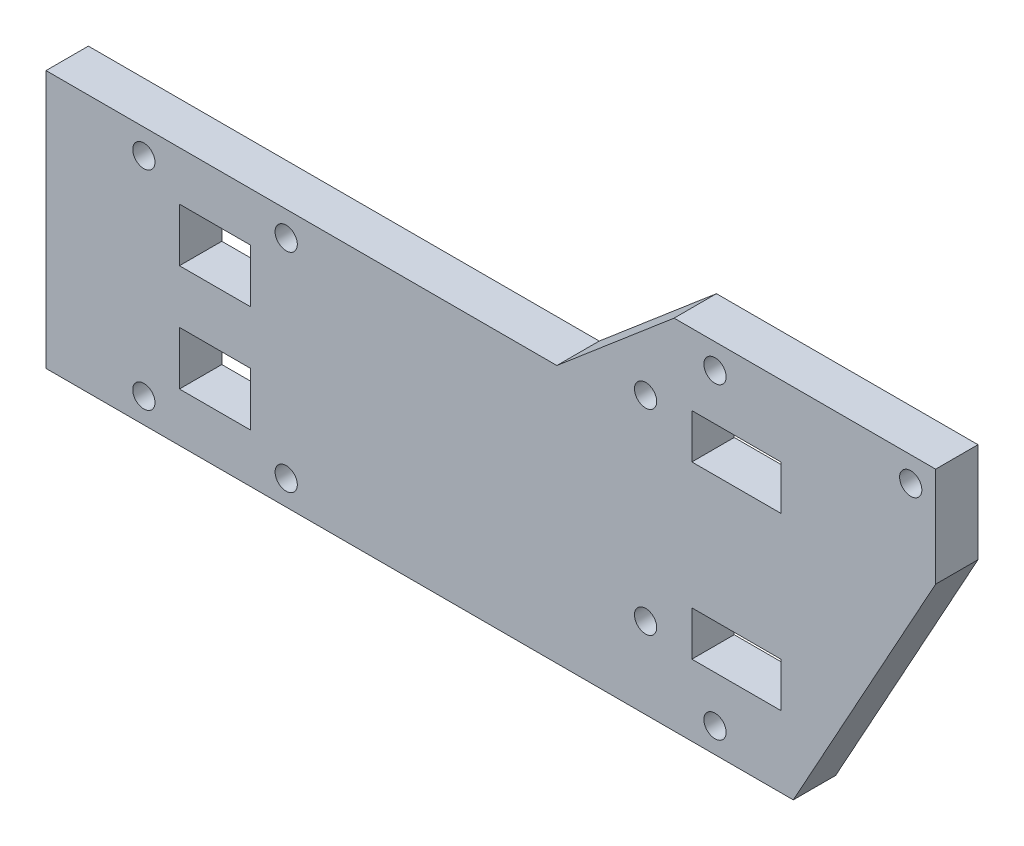
ISO-10303-21;
HEADER;
FILE_DESCRIPTION(('STEP AP214'),'2;1');
FILE_NAME('part.step','',(''),(''),'','','');
FILE_SCHEMA(('AUTOMOTIVE_DESIGN { 1 0 10303 214 1 1 1 1 }'));
ENDSEC;
DATA;
#1=APPLICATION_CONTEXT('core data for automotive mechanical design processes');
#2=APPLICATION_PROTOCOL_DEFINITION('international standard','automotive_design',2000,#1);
#3=PRODUCT_CONTEXT('',#1,'mechanical');
#4=PRODUCT('Part','Part','',(#3));
#5=PRODUCT_RELATED_PRODUCT_CATEGORY('part','',(#4));
#6=PRODUCT_DEFINITION_FORMATION('','',#4);
#7=PRODUCT_DEFINITION_CONTEXT('part definition',#1,'design');
#8=PRODUCT_DEFINITION('design','',#6,#7);
#9=PRODUCT_DEFINITION_SHAPE('','',#8);
#10=(LENGTH_UNIT() NAMED_UNIT(*) SI_UNIT(.MILLI.,.METRE.));
#11=(NAMED_UNIT(*) PLANE_ANGLE_UNIT() SI_UNIT($,.RADIAN.));
#12=(NAMED_UNIT(*) SI_UNIT($,.STERADIAN.) SOLID_ANGLE_UNIT());
#13=UNCERTAINTY_MEASURE_WITH_UNIT(LENGTH_MEASURE(1.E-05),#10,'distance_accuracy_value','');
#14=(GEOMETRIC_REPRESENTATION_CONTEXT(3) GLOBAL_UNCERTAINTY_ASSIGNED_CONTEXT((#13)) GLOBAL_UNIT_ASSIGNED_CONTEXT((#10,
#11,#12)) REPRESENTATION_CONTEXT('',''));
#15=CARTESIAN_POINT('',(0.,0.,0.));
#16=DIRECTION('',(0.,0.,1.));
#17=DIRECTION('',(1.,0.,0.));
#18=AXIS2_PLACEMENT_3D('',#15,#16,#17);
#19=CARTESIAN_POINT('',(0.,29.,4.7625));
#20=DIRECTION('',(1.,0.,0.));
#21=DIRECTION('',(0.,1.,0.));
#22=AXIS2_PLACEMENT_3D('',#19,#20,#21);
#23=PLANE('',#22);
#24=DIRECTION('',(0.,-1.,0.));
#25=VECTOR('',#24,1.);
#26=CARTESIAN_POINT('',(0.,29.,0.));
#27=LINE('',#26,#25);
#28=CARTESIAN_POINT('',(0.,29.,0.));
#29=VERTEX_POINT('',#28);
#30=CARTESIAN_POINT('',(0.,0.,0.));
#31=VERTEX_POINT('',#30);
#32=EDGE_CURVE('E318',#29,#31,#27,.T.);
#33=ORIENTED_EDGE('',*,*,#32,.T.);
#34=DIRECTION('',(0.,0.,-1.));
#35=VECTOR('',#34,1.);
#36=CARTESIAN_POINT('',(0.,0.,4.7625));
#37=LINE('',#36,#35);
#38=CARTESIAN_POINT('',(0.,0.,4.7625));
#39=VERTEX_POINT('',#38);
#40=EDGE_CURVE('E11',#39,#31,#37,.T.);
#41=ORIENTED_EDGE('',*,*,#40,.F.);
#42=DIRECTION('',(0.,-1.,0.));
#43=VECTOR('',#42,1.);
#44=CARTESIAN_POINT('',(0.,29.,4.7625));
#45=LINE('',#44,#43);
#46=CARTESIAN_POINT('',(0.,29.,4.7625));
#47=VERTEX_POINT('',#46);
#48=EDGE_CURVE('E325',#47,#39,#45,.T.);
#49=ORIENTED_EDGE('',*,*,#48,.F.);
#50=DIRECTION('',(0.,0.,-1.));
#51=VECTOR('',#50,1.);
#52=CARTESIAN_POINT('',(0.,29.,4.7625));
#53=LINE('',#52,#51);
#54=EDGE_CURVE('E341',#47,#29,#53,.T.);
#55=ORIENTED_EDGE('',*,*,#54,.T.);
#56=EDGE_LOOP('',(#33,#41,#49,#55));
#57=FACE_BOUND('',#56,.T.);
#58=ADVANCED_FACE('F34',(#57),#23,.F.);
#59=CARTESIAN_POINT('',(84.,0.,4.7625));
#60=DIRECTION('',(0.,1.,0.));
#61=DIRECTION('',(0.,0.,1.));
#62=AXIS2_PLACEMENT_3D('',#59,#60,#61);
#63=PLANE('',#62);
#64=DIRECTION('',(1.,0.,0.));
#65=VECTOR('',#64,1.);
#66=CARTESIAN_POINT('',(84.,0.,0.));
#67=LINE('',#66,#65);
#68=CARTESIAN_POINT('',(84.,0.,0.));
#69=VERTEX_POINT('',#68);
#70=EDGE_CURVE('E344',#31,#69,#67,.T.);
#71=ORIENTED_EDGE('',*,*,#70,.T.);
#72=DIRECTION('',(0.,0.,-1.));
#73=VECTOR('',#72,1.);
#74=CARTESIAN_POINT('',(84.,0.,4.7625));
#75=LINE('',#74,#73);
#76=CARTESIAN_POINT('',(84.,0.,4.7625));
#77=VERTEX_POINT('',#76);
#78=EDGE_CURVE('E41',#77,#69,#75,.T.);
#79=ORIENTED_EDGE('',*,*,#78,.F.);
#80=DIRECTION('',(1.,0.,0.));
#81=VECTOR('',#80,1.);
#82=CARTESIAN_POINT('',(84.,0.,4.7625));
#83=LINE('',#82,#81);
#84=EDGE_CURVE('E328',#39,#77,#83,.T.);
#85=ORIENTED_EDGE('',*,*,#84,.F.);
#86=ORIENTED_EDGE('',*,*,#40,.T.);
#87=EDGE_LOOP('',(#71,#79,#85,#86));
#88=FACE_BOUND('',#87,.T.);
#89=ADVANCED_FACE('F395',(#88),#63,.F.);
#90=CARTESIAN_POINT('',(100.,29.,4.7625));
#91=DIRECTION('',(-0.875577684026794,0.483077342911335,0.));
#92=DIRECTION('',(-0.483077342911335,-0.875577684026794,0.));
#93=AXIS2_PLACEMENT_3D('',#90,#91,#92);
#94=PLANE('',#93);
#95=DIRECTION('',(0.483077342911335,0.875577684026794,0.));
#96=VECTOR('',#95,1.);
#97=CARTESIAN_POINT('',(100.,29.,0.));
#98=LINE('',#97,#96);
#99=CARTESIAN_POINT('',(100.,29.,0.));
#100=VERTEX_POINT('',#99);
#101=EDGE_CURVE('E346',#69,#100,#98,.T.);
#102=ORIENTED_EDGE('',*,*,#101,.T.);
#103=DIRECTION('',(0.,0.,-1.));
#104=VECTOR('',#103,1.);
#105=CARTESIAN_POINT('',(100.,29.,4.7625));
#106=LINE('',#105,#104);
#107=CARTESIAN_POINT('',(100.,29.,4.7625));
#108=VERTEX_POINT('',#107);
#109=EDGE_CURVE('E366',#108,#100,#106,.T.);
#110=ORIENTED_EDGE('',*,*,#109,.F.);
#111=DIRECTION('',(0.483077342911335,0.875577684026794,0.));
#112=VECTOR('',#111,1.);
#113=CARTESIAN_POINT('',(100.,29.,4.7625));
#114=LINE('',#113,#112);
#115=EDGE_CURVE('E331',#77,#108,#114,.T.);
#116=ORIENTED_EDGE('',*,*,#115,.F.);
#117=ORIENTED_EDGE('',*,*,#78,.T.);
#118=EDGE_LOOP('',(#102,#110,#116,#117));
#119=FACE_BOUND('',#118,.T.);
#120=ADVANCED_FACE('F373',(#119),#94,.F.);
#121=CARTESIAN_POINT('',(100.,40.2,4.7625));
#122=DIRECTION('',(-1.,0.,0.));
#123=DIRECTION('',(0.,0.,1.));
#124=AXIS2_PLACEMENT_3D('',#121,#122,#123);
#125=PLANE('',#124);
#126=DIRECTION('',(0.,1.,0.));
#127=VECTOR('',#126,1.);
#128=CARTESIAN_POINT('',(100.,40.2,0.));
#129=LINE('',#128,#127);
#130=CARTESIAN_POINT('',(100.,40.2,0.));
#131=VERTEX_POINT('',#130);
#132=EDGE_CURVE('E348',#100,#131,#129,.T.);
#133=ORIENTED_EDGE('',*,*,#132,.T.);
#134=DIRECTION('',(0.,0.,-1.));
#135=VECTOR('',#134,1.);
#136=CARTESIAN_POINT('',(100.,40.2,4.7625));
#137=LINE('',#136,#135);
#138=CARTESIAN_POINT('',(100.,40.2,4.7625));
#139=VERTEX_POINT('',#138);
#140=EDGE_CURVE('E363',#139,#131,#137,.T.);
#141=ORIENTED_EDGE('',*,*,#140,.F.);
#142=DIRECTION('',(0.,1.,0.));
#143=VECTOR('',#142,1.);
#144=CARTESIAN_POINT('',(100.,40.2,4.7625));
#145=LINE('',#144,#143);
#146=EDGE_CURVE('E333',#108,#139,#145,.T.);
#147=ORIENTED_EDGE('',*,*,#146,.F.);
#148=ORIENTED_EDGE('',*,*,#109,.T.);
#149=EDGE_LOOP('',(#133,#141,#147,#148));
#150=FACE_BOUND('',#149,.T.);
#151=ADVANCED_FACE('F383',(#150),#125,.F.);
#152=CARTESIAN_POINT('',(70.6,40.2,4.7625));
#153=DIRECTION('',(0.,-1.,0.));
#154=DIRECTION('',(0.,0.,-1.));
#155=AXIS2_PLACEMENT_3D('',#152,#153,#154);
#156=PLANE('',#155);
#157=DIRECTION('',(-1.,0.,0.));
#158=VECTOR('',#157,1.);
#159=CARTESIAN_POINT('',(70.6,40.2,0.));
#160=LINE('',#159,#158);
#161=CARTESIAN_POINT('',(70.6,40.2,0.));
#162=VERTEX_POINT('',#161);
#163=EDGE_CURVE('E350',#131,#162,#160,.T.);
#164=ORIENTED_EDGE('',*,*,#163,.T.);
#165=DIRECTION('',(0.,0.,-1.));
#166=VECTOR('',#165,1.);
#167=CARTESIAN_POINT('',(70.6,40.2,4.7625));
#168=LINE('',#167,#166);
#169=CARTESIAN_POINT('',(70.6,40.2,4.7625));
#170=VERTEX_POINT('',#169);
#171=EDGE_CURVE('E360',#170,#162,#168,.T.);
#172=ORIENTED_EDGE('',*,*,#171,.F.);
#173=DIRECTION('',(-1.,0.,0.));
#174=VECTOR('',#173,1.);
#175=CARTESIAN_POINT('',(70.6,40.2,4.7625));
#176=LINE('',#175,#174);
#177=EDGE_CURVE('E335',#139,#170,#176,.T.);
#178=ORIENTED_EDGE('',*,*,#177,.F.);
#179=ORIENTED_EDGE('',*,*,#140,.T.);
#180=EDGE_LOOP('',(#164,#172,#178,#179));
#181=FACE_BOUND('',#180,.T.);
#182=ADVANCED_FACE('F387',(#181),#156,.F.);
#183=CARTESIAN_POINT('',(70.6,40.2,4.7625));
#184=DIRECTION('',(0.647648420095539,-0.761939317759461,0.));
#185=DIRECTION('',(0.761939317759461,0.647648420095539,0.));
#186=AXIS2_PLACEMENT_3D('',#183,#184,#185);
#187=PLANE('',#186);
#188=DIRECTION('',(-0.761939317759461,-0.647648420095539,0.));
#189=VECTOR('',#188,1.);
#190=CARTESIAN_POINT('',(70.6,40.2,0.));
#191=LINE('',#190,#189);
#192=CARTESIAN_POINT('',(57.4235294117647,29.,0.));
#193=VERTEX_POINT('',#192);
#194=EDGE_CURVE('E352',#162,#193,#191,.T.);
#195=ORIENTED_EDGE('',*,*,#194,.T.);
#196=DIRECTION('',(0.,0.,-1.));
#197=VECTOR('',#196,1.);
#198=CARTESIAN_POINT('',(57.4235294117647,29.,4.7625));
#199=LINE('',#198,#197);
#200=CARTESIAN_POINT('',(57.4235294117647,29.,4.7625));
#201=VERTEX_POINT('',#200);
#202=EDGE_CURVE('E357',#201,#193,#199,.T.);
#203=ORIENTED_EDGE('',*,*,#202,.F.);
#204=DIRECTION('',(-0.761939317759461,-0.647648420095539,0.));
#205=VECTOR('',#204,1.);
#206=CARTESIAN_POINT('',(70.6,40.2,4.7625));
#207=LINE('',#206,#205);
#208=EDGE_CURVE('E337',#170,#201,#207,.T.);
#209=ORIENTED_EDGE('',*,*,#208,.F.);
#210=ORIENTED_EDGE('',*,*,#171,.T.);
#211=EDGE_LOOP('',(#195,#203,#209,#210));
#212=FACE_BOUND('',#211,.T.);
#213=ADVANCED_FACE('F403',(#212),#187,.F.);
#214=CARTESIAN_POINT('',(57.4235294117647,29.,4.7625));
#215=DIRECTION('',(0.,-1.,0.));
#216=DIRECTION('',(1.,0.,0.));
#217=AXIS2_PLACEMENT_3D('',#214,#215,#216);
#218=PLANE('',#217);
#219=DIRECTION('',(-1.,0.,0.));
#220=VECTOR('',#219,1.);
#221=CARTESIAN_POINT('',(57.4235294117647,29.,0.));
#222=LINE('',#221,#220);
#223=EDGE_CURVE('E329',#193,#29,#222,.T.);
#224=ORIENTED_EDGE('',*,*,#223,.T.);
#225=ORIENTED_EDGE('',*,*,#54,.F.);
#226=DIRECTION('',(-1.,0.,0.));
#227=VECTOR('',#226,1.);
#228=CARTESIAN_POINT('',(57.4235294117647,29.,4.7625));
#229=LINE('',#228,#227);
#230=EDGE_CURVE('E339',#201,#47,#229,.T.);
#231=ORIENTED_EDGE('',*,*,#230,.F.);
#232=ORIENTED_EDGE('',*,*,#202,.T.);
#233=EDGE_LOOP('',(#224,#225,#231,#232));
#234=FACE_BOUND('',#233,.T.);
#235=ADVANCED_FACE('F400',(#234),#218,.F.);
#236=CARTESIAN_POINT('',(0.,0.,4.7625));
#237=DIRECTION('',(0.,0.,-1.));
#238=DIRECTION('',(-1.,0.,0.));
#239=AXIS2_PLACEMENT_3D('',#236,#237,#238);
#240=PLANE('',#239);
#241=CARTESIAN_POINT('',(11.,2.8,4.7625));
#242=DIRECTION('',(0.,0.,1.));
#243=DIRECTION('',(1.,0.,0.));
#244=AXIS2_PLACEMENT_3D('',#241,#242,#243);
#245=CIRCLE('',#244,1.25);
#246=CARTESIAN_POINT('',(12.25,2.8,4.7625));
#247=VERTEX_POINT('',#246);
#248=EDGE_CURVE('E713',#247,#247,#245,.T.);
#249=ORIENTED_EDGE('',*,*,#248,.F.);
#250=EDGE_LOOP('',(#249));
#251=FACE_BOUND('',#250,.T.);
#252=CARTESIAN_POINT('',(27.,2.8,4.7625));
#253=DIRECTION('',(0.,0.,1.));
#254=DIRECTION('',(1.,0.,0.));
#255=AXIS2_PLACEMENT_3D('',#252,#253,#254);
#256=CIRCLE('',#255,1.25);
#257=CARTESIAN_POINT('',(28.25,2.8,4.7625));
#258=VERTEX_POINT('',#257);
#259=EDGE_CURVE('E715',#258,#258,#256,.T.);
#260=ORIENTED_EDGE('',*,*,#259,.F.);
#261=EDGE_LOOP('',(#260));
#262=FACE_BOUND('',#261,.T.);
#263=CARTESIAN_POINT('',(27.,26.2,4.7625));
#264=DIRECTION('',(0.,0.,1.));
#265=DIRECTION('',(1.,0.,0.));
#266=AXIS2_PLACEMENT_3D('',#263,#264,#265);
#267=CIRCLE('',#266,1.25);
#268=CARTESIAN_POINT('',(28.25,26.2,4.7625));
#269=VERTEX_POINT('',#268);
#270=EDGE_CURVE('E721',#269,#269,#267,.T.);
#271=ORIENTED_EDGE('',*,*,#270,.F.);
#272=EDGE_LOOP('',(#271));
#273=FACE_BOUND('',#272,.T.);
#274=CARTESIAN_POINT('',(11.,26.2,4.7625));
#275=DIRECTION('',(0.,0.,1.));
#276=DIRECTION('',(1.,0.,0.));
#277=AXIS2_PLACEMENT_3D('',#274,#275,#276);
#278=CIRCLE('',#277,1.25);
#279=CARTESIAN_POINT('',(12.25,26.2,4.7625));
#280=VERTEX_POINT('',#279);
#281=EDGE_CURVE('E727',#280,#280,#278,.T.);
#282=ORIENTED_EDGE('',*,*,#281,.F.);
#283=EDGE_LOOP('',(#282));
#284=FACE_BOUND('',#283,.T.);
#285=CARTESIAN_POINT('',(75.2,2.8,4.7625));
#286=DIRECTION('',(0.,0.,1.));
#287=DIRECTION('',(1.,0.,0.));
#288=AXIS2_PLACEMENT_3D('',#285,#286,#287);
#289=CIRCLE('',#288,1.25);
#290=CARTESIAN_POINT('',(76.45,2.8,4.7625));
#291=VERTEX_POINT('',#290);
#292=EDGE_CURVE('E733',#291,#291,#289,.T.);
#293=ORIENTED_EDGE('',*,*,#292,.F.);
#294=EDGE_LOOP('',(#293));
#295=FACE_BOUND('',#294,.T.);
#296=CARTESIAN_POINT('',(67.4,9.1,4.7625));
#297=DIRECTION('',(0.,0.,1.));
#298=DIRECTION('',(1.,0.,0.));
#299=AXIS2_PLACEMENT_3D('',#296,#297,#298);
#300=CIRCLE('',#299,1.25);
#301=CARTESIAN_POINT('',(68.65,9.1,4.7625));
#302=VERTEX_POINT('',#301);
#303=EDGE_CURVE('E739',#302,#302,#300,.T.);
#304=ORIENTED_EDGE('',*,*,#303,.F.);
#305=EDGE_LOOP('',(#304));
#306=FACE_BOUND('',#305,.T.);
#307=CARTESIAN_POINT('',(67.4,31.1,4.7625));
#308=DIRECTION('',(0.,0.,1.));
#309=DIRECTION('',(1.,0.,0.));
#310=AXIS2_PLACEMENT_3D('',#307,#308,#309);
#311=CIRCLE('',#310,1.25);
#312=CARTESIAN_POINT('',(68.65,31.1,4.7625));
#313=VERTEX_POINT('',#312);
#314=EDGE_CURVE('E745',#313,#313,#311,.T.);
#315=ORIENTED_EDGE('',*,*,#314,.F.);
#316=EDGE_LOOP('',(#315));
#317=FACE_BOUND('',#316,.T.);
#318=CARTESIAN_POINT('',(75.2,37.4,4.7625));
#319=DIRECTION('',(0.,0.,1.));
#320=DIRECTION('',(1.,0.,0.));
#321=AXIS2_PLACEMENT_3D('',#318,#319,#320);
#322=CIRCLE('',#321,1.25);
#323=CARTESIAN_POINT('',(76.45,37.4,4.7625));
#324=VERTEX_POINT('',#323);
#325=EDGE_CURVE('E751',#324,#324,#322,.T.);
#326=ORIENTED_EDGE('',*,*,#325,.F.);
#327=EDGE_LOOP('',(#326));
#328=FACE_BOUND('',#327,.T.);
#329=CARTESIAN_POINT('',(97.2,37.4,4.7625));
#330=DIRECTION('',(0.,0.,1.));
#331=DIRECTION('',(1.,0.,0.));
#332=AXIS2_PLACEMENT_3D('',#329,#330,#331);
#333=CIRCLE('',#332,1.25);
#334=CARTESIAN_POINT('',(98.45,37.4,4.7625));
#335=VERTEX_POINT('',#334);
#336=EDGE_CURVE('E212',#335,#335,#333,.T.);
#337=ORIENTED_EDGE('',*,*,#336,.F.);
#338=EDGE_LOOP('',(#337));
#339=FACE_BOUND('',#338,.T.);
#340=DIRECTION('',(-1.,0.,0.));
#341=VECTOR('',#340,1.);
#342=CARTESIAN_POINT('',(15.,11.5,4.7625));
#343=LINE('',#342,#341);
#344=CARTESIAN_POINT('',(23.,11.5,4.7625));
#345=VERTEX_POINT('',#344);
#346=CARTESIAN_POINT('',(15.,11.5,4.7625));
#347=VERTEX_POINT('',#346);
#348=EDGE_CURVE('E218',#345,#347,#343,.T.);
#349=ORIENTED_EDGE('',*,*,#348,.F.);
#350=DIRECTION('',(0.,1.,0.));
#351=VECTOR('',#350,1.);
#352=CARTESIAN_POINT('',(23.,5.5,4.7625));
#353=LINE('',#352,#351);
#354=CARTESIAN_POINT('',(23.,5.5,4.7625));
#355=VERTEX_POINT('',#354);
#356=EDGE_CURVE('E48',#355,#345,#353,.T.);
#357=ORIENTED_EDGE('',*,*,#356,.F.);
#358=DIRECTION('',(1.,0.,0.));
#359=VECTOR('',#358,1.);
#360=CARTESIAN_POINT('',(15.,5.5,4.7625));
#361=LINE('',#360,#359);
#362=CARTESIAN_POINT('',(15.,5.5,4.7625));
#363=VERTEX_POINT('',#362);
#364=EDGE_CURVE('E206',#363,#355,#361,.T.);
#365=ORIENTED_EDGE('',*,*,#364,.F.);
#366=DIRECTION('',(0.,-1.,0.));
#367=VECTOR('',#366,1.);
#368=CARTESIAN_POINT('',(15.,5.5,4.7625));
#369=LINE('',#368,#367);
#370=EDGE_CURVE('E209',#347,#363,#369,.T.);
#371=ORIENTED_EDGE('',*,*,#370,.F.);
#372=EDGE_LOOP('',(#349,#357,#365,#371));
#373=FACE_BOUND('',#372,.T.);
#374=DIRECTION('',(-1.,0.,0.));
#375=VECTOR('',#374,1.);
#376=CARTESIAN_POINT('',(15.,23.5,4.7625));
#377=LINE('',#376,#375);
#378=CARTESIAN_POINT('',(23.,23.5,4.7625));
#379=VERTEX_POINT('',#378);
#380=CARTESIAN_POINT('',(15.,23.5,4.7625));
#381=VERTEX_POINT('',#380);
#382=EDGE_CURVE('E244',#379,#381,#377,.T.);
#383=ORIENTED_EDGE('',*,*,#382,.F.);
#384=DIRECTION('',(0.,1.,0.));
#385=VECTOR('',#384,1.);
#386=CARTESIAN_POINT('',(23.,17.5,4.7625));
#387=LINE('',#386,#385);
#388=CARTESIAN_POINT('',(23.,17.5,4.7625));
#389=VERTEX_POINT('',#388);
#390=EDGE_CURVE('E225',#389,#379,#387,.T.);
#391=ORIENTED_EDGE('',*,*,#390,.F.);
#392=DIRECTION('',(1.,0.,0.));
#393=VECTOR('',#392,1.);
#394=CARTESIAN_POINT('',(15.,17.5,4.7625));
#395=LINE('',#394,#393);
#396=CARTESIAN_POINT('',(15.,17.5,4.7625));
#397=VERTEX_POINT('',#396);
#398=EDGE_CURVE('E233',#397,#389,#395,.T.);
#399=ORIENTED_EDGE('',*,*,#398,.F.);
#400=DIRECTION('',(0.,-1.,0.));
#401=VECTOR('',#400,1.);
#402=CARTESIAN_POINT('',(15.,17.5,4.7625));
#403=LINE('',#402,#401);
#404=EDGE_CURVE('E247',#381,#397,#403,.T.);
#405=ORIENTED_EDGE('',*,*,#404,.F.);
#406=EDGE_LOOP('',(#383,#391,#399,#405));
#407=FACE_BOUND('',#406,.T.);
#408=DIRECTION('',(-1.,0.,0.));
#409=VECTOR('',#408,1.);
#410=CARTESIAN_POINT('',(72.6,13.,4.7625));
#411=LINE('',#410,#409);
#412=CARTESIAN_POINT('',(82.6,13.,4.7625));
#413=VERTEX_POINT('',#412);
#414=CARTESIAN_POINT('',(72.6,13.,4.7625));
#415=VERTEX_POINT('',#414);
#416=EDGE_CURVE('E276',#413,#415,#411,.T.);
#417=ORIENTED_EDGE('',*,*,#416,.F.);
#418=DIRECTION('',(0.,1.,0.));
#419=VECTOR('',#418,1.);
#420=CARTESIAN_POINT('',(82.6,13.,4.7625));
#421=LINE('',#420,#419);
#422=CARTESIAN_POINT('',(82.6,8.,4.7625));
#423=VERTEX_POINT('',#422);
#424=EDGE_CURVE('E254',#423,#413,#421,.T.);
#425=ORIENTED_EDGE('',*,*,#424,.F.);
#426=DIRECTION('',(1.,0.,0.));
#427=VECTOR('',#426,1.);
#428=CARTESIAN_POINT('',(72.6,8.,4.7625));
#429=LINE('',#428,#427);
#430=CARTESIAN_POINT('',(72.6,8.,4.7625));
#431=VERTEX_POINT('',#430);
#432=EDGE_CURVE('E265',#431,#423,#429,.T.);
#433=ORIENTED_EDGE('',*,*,#432,.F.);
#434=DIRECTION('',(0.,-1.,0.));
#435=VECTOR('',#434,1.);
#436=CARTESIAN_POINT('',(72.6,13.,4.7625));
#437=LINE('',#436,#435);
#438=EDGE_CURVE('E279',#415,#431,#437,.T.);
#439=ORIENTED_EDGE('',*,*,#438,.F.);
#440=EDGE_LOOP('',(#417,#425,#433,#439));
#441=FACE_BOUND('',#440,.T.);
#442=DIRECTION('',(-1.,0.,0.));
#443=VECTOR('',#442,1.);
#444=CARTESIAN_POINT('',(72.6,32.2,4.7625));
#445=LINE('',#444,#443);
#446=CARTESIAN_POINT('',(82.6,32.2,4.7625));
#447=VERTEX_POINT('',#446);
#448=CARTESIAN_POINT('',(72.6,32.2,4.7625));
#449=VERTEX_POINT('',#448);
#450=EDGE_CURVE('E308',#447,#449,#445,.T.);
#451=ORIENTED_EDGE('',*,*,#450,.F.);
#452=DIRECTION('',(0.,1.,0.));
#453=VECTOR('',#452,1.);
#454=CARTESIAN_POINT('',(82.6,27.2,4.7625));
#455=LINE('',#454,#453);
#456=CARTESIAN_POINT('',(82.6,27.2,4.7625));
#457=VERTEX_POINT('',#456);
#458=EDGE_CURVE('E286',#457,#447,#455,.T.);
#459=ORIENTED_EDGE('',*,*,#458,.F.);
#460=DIRECTION('',(1.,0.,0.));
#461=VECTOR('',#460,1.);
#462=CARTESIAN_POINT('',(72.6,27.2,4.7625));
#463=LINE('',#462,#461);
#464=CARTESIAN_POINT('',(72.6,27.2,4.7625));
#465=VERTEX_POINT('',#464);
#466=EDGE_CURVE('E297',#465,#457,#463,.T.);
#467=ORIENTED_EDGE('',*,*,#466,.F.);
#468=DIRECTION('',(0.,-1.,0.));
#469=VECTOR('',#468,1.);
#470=CARTESIAN_POINT('',(72.6,27.2,4.7625));
#471=LINE('',#470,#469);
#472=EDGE_CURVE('E311',#449,#465,#471,.T.);
#473=ORIENTED_EDGE('',*,*,#472,.F.);
#474=EDGE_LOOP('',(#451,#459,#467,#473));
#475=FACE_BOUND('',#474,.T.);
#476=ORIENTED_EDGE('',*,*,#48,.T.);
#477=ORIENTED_EDGE('',*,*,#84,.T.);
#478=ORIENTED_EDGE('',*,*,#115,.T.);
#479=ORIENTED_EDGE('',*,*,#146,.T.);
#480=ORIENTED_EDGE('',*,*,#177,.T.);
#481=ORIENTED_EDGE('',*,*,#208,.T.);
#482=ORIENTED_EDGE('',*,*,#230,.T.);
#483=EDGE_LOOP('',(#476,#477,#478,#479,#480,#481,#482));
#484=FACE_BOUND('',#483,.T.);
#485=ADVANCED_FACE('F391',(#251,#262,#273,#284,#295,#306,#317,#328,#339,#373,#407,#441,#475,
#484),#240,.F.);
#486=CARTESIAN_POINT('',(0.,0.,0.));
#487=DIRECTION('',(0.,0.,-1.));
#488=DIRECTION('',(-1.,0.,0.));
#489=AXIS2_PLACEMENT_3D('',#486,#487,#488);
#490=PLANE('',#489);
#491=CARTESIAN_POINT('',(11.,2.8,0.));
#492=DIRECTION('',(0.,0.,1.));
#493=DIRECTION('',(1.,0.,0.));
#494=AXIS2_PLACEMENT_3D('',#491,#492,#493);
#495=CIRCLE('',#494,1.25);
#496=CARTESIAN_POINT('',(12.25,2.8,0.));
#497=VERTEX_POINT('',#496);
#498=EDGE_CURVE('E710',#497,#497,#495,.T.);
#499=ORIENTED_EDGE('',*,*,#498,.T.);
#500=EDGE_LOOP('',(#499));
#501=FACE_BOUND('',#500,.T.);
#502=CARTESIAN_POINT('',(27.,2.8,0.));
#503=DIRECTION('',(0.,0.,1.));
#504=DIRECTION('',(1.,0.,0.));
#505=AXIS2_PLACEMENT_3D('',#502,#503,#504);
#506=CIRCLE('',#505,1.25);
#507=CARTESIAN_POINT('',(28.25,2.8,0.));
#508=VERTEX_POINT('',#507);
#509=EDGE_CURVE('E718',#508,#508,#506,.T.);
#510=ORIENTED_EDGE('',*,*,#509,.T.);
#511=EDGE_LOOP('',(#510));
#512=FACE_BOUND('',#511,.T.);
#513=CARTESIAN_POINT('',(27.,26.2,0.));
#514=DIRECTION('',(0.,0.,1.));
#515=DIRECTION('',(1.,0.,0.));
#516=AXIS2_PLACEMENT_3D('',#513,#514,#515);
#517=CIRCLE('',#516,1.25);
#518=CARTESIAN_POINT('',(28.25,26.2,0.));
#519=VERTEX_POINT('',#518);
#520=EDGE_CURVE('E724',#519,#519,#517,.T.);
#521=ORIENTED_EDGE('',*,*,#520,.T.);
#522=EDGE_LOOP('',(#521));
#523=FACE_BOUND('',#522,.T.);
#524=CARTESIAN_POINT('',(11.,26.2,0.));
#525=DIRECTION('',(0.,0.,1.));
#526=DIRECTION('',(1.,0.,0.));
#527=AXIS2_PLACEMENT_3D('',#524,#525,#526);
#528=CIRCLE('',#527,1.25);
#529=CARTESIAN_POINT('',(12.25,26.2,0.));
#530=VERTEX_POINT('',#529);
#531=EDGE_CURVE('E730',#530,#530,#528,.T.);
#532=ORIENTED_EDGE('',*,*,#531,.T.);
#533=EDGE_LOOP('',(#532));
#534=FACE_BOUND('',#533,.T.);
#535=CARTESIAN_POINT('',(75.2,2.8,0.));
#536=DIRECTION('',(0.,0.,1.));
#537=DIRECTION('',(1.,0.,0.));
#538=AXIS2_PLACEMENT_3D('',#535,#536,#537);
#539=CIRCLE('',#538,1.25);
#540=CARTESIAN_POINT('',(76.45,2.8,0.));
#541=VERTEX_POINT('',#540);
#542=EDGE_CURVE('E736',#541,#541,#539,.T.);
#543=ORIENTED_EDGE('',*,*,#542,.T.);
#544=EDGE_LOOP('',(#543));
#545=FACE_BOUND('',#544,.T.);
#546=CARTESIAN_POINT('',(67.4,9.1,0.));
#547=DIRECTION('',(0.,0.,1.));
#548=DIRECTION('',(1.,0.,0.));
#549=AXIS2_PLACEMENT_3D('',#546,#547,#548);
#550=CIRCLE('',#549,1.25);
#551=CARTESIAN_POINT('',(68.65,9.1,0.));
#552=VERTEX_POINT('',#551);
#553=EDGE_CURVE('E742',#552,#552,#550,.T.);
#554=ORIENTED_EDGE('',*,*,#553,.T.);
#555=EDGE_LOOP('',(#554));
#556=FACE_BOUND('',#555,.T.);
#557=CARTESIAN_POINT('',(67.4,31.1,0.));
#558=DIRECTION('',(0.,0.,1.));
#559=DIRECTION('',(1.,0.,0.));
#560=AXIS2_PLACEMENT_3D('',#557,#558,#559);
#561=CIRCLE('',#560,1.25);
#562=CARTESIAN_POINT('',(68.65,31.1,0.));
#563=VERTEX_POINT('',#562);
#564=EDGE_CURVE('E748',#563,#563,#561,.T.);
#565=ORIENTED_EDGE('',*,*,#564,.T.);
#566=EDGE_LOOP('',(#565));
#567=FACE_BOUND('',#566,.T.);
#568=CARTESIAN_POINT('',(75.2,37.4,0.));
#569=DIRECTION('',(0.,0.,1.));
#570=DIRECTION('',(1.,0.,0.));
#571=AXIS2_PLACEMENT_3D('',#568,#569,#570);
#572=CIRCLE('',#571,1.25);
#573=CARTESIAN_POINT('',(76.45,37.4,0.));
#574=VERTEX_POINT('',#573);
#575=EDGE_CURVE('E754',#574,#574,#572,.T.);
#576=ORIENTED_EDGE('',*,*,#575,.T.);
#577=EDGE_LOOP('',(#576));
#578=FACE_BOUND('',#577,.T.);
#579=CARTESIAN_POINT('',(97.2,37.4,0.));
#580=DIRECTION('',(0.,0.,1.));
#581=DIRECTION('',(1.,0.,0.));
#582=AXIS2_PLACEMENT_3D('',#579,#580,#581);
#583=CIRCLE('',#582,1.25);
#584=CARTESIAN_POINT('',(98.45,37.4,0.));
#585=VERTEX_POINT('',#584);
#586=EDGE_CURVE('E219',#585,#585,#583,.T.);
#587=ORIENTED_EDGE('',*,*,#586,.T.);
#588=EDGE_LOOP('',(#587));
#589=FACE_BOUND('',#588,.T.);
#590=DIRECTION('',(0.,1.,0.));
#591=VECTOR('',#590,1.);
#592=CARTESIAN_POINT('',(23.,5.5,0.));
#593=LINE('',#592,#591);
#594=CARTESIAN_POINT('',(23.,5.5,0.));
#595=VERTEX_POINT('',#594);
#596=CARTESIAN_POINT('',(23.,11.5,0.));
#597=VERTEX_POINT('',#596);
#598=EDGE_CURVE('E190',#595,#597,#593,.T.);
#599=ORIENTED_EDGE('',*,*,#598,.T.);
#600=DIRECTION('',(-1.,0.,0.));
#601=VECTOR('',#600,1.);
#602=CARTESIAN_POINT('',(15.,11.5,0.));
#603=LINE('',#602,#601);
#604=CARTESIAN_POINT('',(15.,11.5,0.));
#605=VERTEX_POINT('',#604);
#606=EDGE_CURVE('E199',#597,#605,#603,.T.);
#607=ORIENTED_EDGE('',*,*,#606,.T.);
#608=DIRECTION('',(0.,-1.,0.));
#609=VECTOR('',#608,1.);
#610=CARTESIAN_POINT('',(15.,5.5,0.));
#611=LINE('',#610,#609);
#612=CARTESIAN_POINT('',(15.,5.5,0.));
#613=VERTEX_POINT('',#612);
#614=EDGE_CURVE('E56',#605,#613,#611,.T.);
#615=ORIENTED_EDGE('',*,*,#614,.T.);
#616=DIRECTION('',(1.,0.,0.));
#617=VECTOR('',#616,1.);
#618=CARTESIAN_POINT('',(15.,5.5,0.));
#619=LINE('',#618,#617);
#620=EDGE_CURVE('E196',#613,#595,#619,.T.);
#621=ORIENTED_EDGE('',*,*,#620,.T.);
#622=EDGE_LOOP('',(#599,#607,#615,#621));
#623=FACE_BOUND('',#622,.T.);
#624=DIRECTION('',(0.,1.,0.));
#625=VECTOR('',#624,1.);
#626=CARTESIAN_POINT('',(23.,17.5,0.));
#627=LINE('',#626,#625);
#628=CARTESIAN_POINT('',(23.,17.5,0.));
#629=VERTEX_POINT('',#628);
#630=CARTESIAN_POINT('',(23.,23.5,0.));
#631=VERTEX_POINT('',#630);
#632=EDGE_CURVE('E229',#629,#631,#627,.T.);
#633=ORIENTED_EDGE('',*,*,#632,.T.);
#634=DIRECTION('',(-1.,0.,0.));
#635=VECTOR('',#634,1.);
#636=CARTESIAN_POINT('',(15.,23.5,0.));
#637=LINE('',#636,#635);
#638=CARTESIAN_POINT('',(15.,23.5,0.));
#639=VERTEX_POINT('',#638);
#640=EDGE_CURVE('E232',#631,#639,#637,.T.);
#641=ORIENTED_EDGE('',*,*,#640,.T.);
#642=DIRECTION('',(0.,-1.,0.));
#643=VECTOR('',#642,1.);
#644=CARTESIAN_POINT('',(15.,17.5,0.));
#645=LINE('',#644,#643);
#646=CARTESIAN_POINT('',(15.,17.5,0.));
#647=VERTEX_POINT('',#646);
#648=EDGE_CURVE('E236',#639,#647,#645,.T.);
#649=ORIENTED_EDGE('',*,*,#648,.T.);
#650=DIRECTION('',(1.,0.,0.));
#651=VECTOR('',#650,1.);
#652=CARTESIAN_POINT('',(15.,17.5,0.));
#653=LINE('',#652,#651);
#654=EDGE_CURVE('E239',#647,#629,#653,.T.);
#655=ORIENTED_EDGE('',*,*,#654,.T.);
#656=EDGE_LOOP('',(#633,#641,#649,#655));
#657=FACE_BOUND('',#656,.T.);
#658=DIRECTION('',(0.,1.,0.));
#659=VECTOR('',#658,1.);
#660=CARTESIAN_POINT('',(82.6,13.,0.));
#661=LINE('',#660,#659);
#662=CARTESIAN_POINT('',(82.6,8.,0.));
#663=VERTEX_POINT('',#662);
#664=CARTESIAN_POINT('',(82.6,13.,0.));
#665=VERTEX_POINT('',#664);
#666=EDGE_CURVE('E261',#663,#665,#661,.T.);
#667=ORIENTED_EDGE('',*,*,#666,.T.);
#668=DIRECTION('',(-1.,0.,0.));
#669=VECTOR('',#668,1.);
#670=CARTESIAN_POINT('',(72.6,13.,0.));
#671=LINE('',#670,#669);
#672=CARTESIAN_POINT('',(72.6,13.,0.));
#673=VERTEX_POINT('',#672);
#674=EDGE_CURVE('E264',#665,#673,#671,.T.);
#675=ORIENTED_EDGE('',*,*,#674,.T.);
#676=DIRECTION('',(0.,-1.,0.));
#677=VECTOR('',#676,1.);
#678=CARTESIAN_POINT('',(72.6,13.,0.));
#679=LINE('',#678,#677);
#680=CARTESIAN_POINT('',(72.6,8.,0.));
#681=VERTEX_POINT('',#680);
#682=EDGE_CURVE('E268',#673,#681,#679,.T.);
#683=ORIENTED_EDGE('',*,*,#682,.T.);
#684=DIRECTION('',(1.,0.,0.));
#685=VECTOR('',#684,1.);
#686=CARTESIAN_POINT('',(72.6,8.,0.));
#687=LINE('',#686,#685);
#688=EDGE_CURVE('E271',#681,#663,#687,.T.);
#689=ORIENTED_EDGE('',*,*,#688,.T.);
#690=EDGE_LOOP('',(#667,#675,#683,#689));
#691=FACE_BOUND('',#690,.T.);
#692=DIRECTION('',(0.,1.,0.));
#693=VECTOR('',#692,1.);
#694=CARTESIAN_POINT('',(82.6,27.2,0.));
#695=LINE('',#694,#693);
#696=CARTESIAN_POINT('',(82.6,27.2,0.));
#697=VERTEX_POINT('',#696);
#698=CARTESIAN_POINT('',(82.6,32.2,0.));
#699=VERTEX_POINT('',#698);
#700=EDGE_CURVE('E293',#697,#699,#695,.T.);
#701=ORIENTED_EDGE('',*,*,#700,.T.);
#702=DIRECTION('',(-1.,0.,0.));
#703=VECTOR('',#702,1.);
#704=CARTESIAN_POINT('',(72.6,32.2,0.));
#705=LINE('',#704,#703);
#706=CARTESIAN_POINT('',(72.6,32.2,0.));
#707=VERTEX_POINT('',#706);
#708=EDGE_CURVE('E296',#699,#707,#705,.T.);
#709=ORIENTED_EDGE('',*,*,#708,.T.);
#710=DIRECTION('',(0.,-1.,0.));
#711=VECTOR('',#710,1.);
#712=CARTESIAN_POINT('',(72.6,27.2,0.));
#713=LINE('',#712,#711);
#714=CARTESIAN_POINT('',(72.6,27.2,0.));
#715=VERTEX_POINT('',#714);
#716=EDGE_CURVE('E300',#707,#715,#713,.T.);
#717=ORIENTED_EDGE('',*,*,#716,.T.);
#718=DIRECTION('',(1.,0.,0.));
#719=VECTOR('',#718,1.);
#720=CARTESIAN_POINT('',(72.6,27.2,0.));
#721=LINE('',#720,#719);
#722=EDGE_CURVE('E303',#715,#697,#721,.T.);
#723=ORIENTED_EDGE('',*,*,#722,.T.);
#724=EDGE_LOOP('',(#701,#709,#717,#723));
#725=FACE_BOUND('',#724,.T.);
#726=ORIENTED_EDGE('',*,*,#32,.F.);
#727=ORIENTED_EDGE('',*,*,#223,.F.);
#728=ORIENTED_EDGE('',*,*,#194,.F.);
#729=ORIENTED_EDGE('',*,*,#163,.F.);
#730=ORIENTED_EDGE('',*,*,#132,.F.);
#731=ORIENTED_EDGE('',*,*,#101,.F.);
#732=ORIENTED_EDGE('',*,*,#70,.F.);
#733=EDGE_LOOP('',(#726,#727,#728,#729,#730,#731,#732));
#734=FACE_BOUND('',#733,.T.);
#735=ADVANCED_FACE('F203',(#501,#512,#523,#534,#545,#556,#567,#578,#589,#623,#657,#691,#725,
#734),#490,.T.);
#736=CARTESIAN_POINT('',(82.6,27.2,0.));
#737=DIRECTION('',(1.,0.,0.));
#738=DIRECTION('',(0.,0.,-1.));
#739=AXIS2_PLACEMENT_3D('',#736,#737,#738);
#740=PLANE('',#739);
#741=ORIENTED_EDGE('',*,*,#458,.T.);
#742=DIRECTION('',(0.,0.,1.));
#743=VECTOR('',#742,1.);
#744=CARTESIAN_POINT('',(82.6,32.2,0.));
#745=LINE('',#744,#743);
#746=EDGE_CURVE('E306',#699,#447,#745,.T.);
#747=ORIENTED_EDGE('',*,*,#746,.F.);
#748=ORIENTED_EDGE('',*,*,#700,.F.);
#749=DIRECTION('',(0.,0.,1.));
#750=VECTOR('',#749,1.);
#751=CARTESIAN_POINT('',(82.6,27.2,0.));
#752=LINE('',#751,#750);
#753=EDGE_CURVE('E316',#697,#457,#752,.T.);
#754=ORIENTED_EDGE('',*,*,#753,.T.);
#755=EDGE_LOOP('',(#741,#747,#748,#754));
#756=FACE_BOUND('',#755,.T.);
#757=ADVANCED_FACE('F458',(#756),#740,.F.);
#758=CARTESIAN_POINT('',(72.6,27.2,0.));
#759=DIRECTION('',(0.,-1.,0.));
#760=DIRECTION('',(0.,0.,-1.));
#761=AXIS2_PLACEMENT_3D('',#758,#759,#760);
#762=PLANE('',#761);
#763=ORIENTED_EDGE('',*,*,#466,.T.);
#764=ORIENTED_EDGE('',*,*,#753,.F.);
#765=ORIENTED_EDGE('',*,*,#722,.F.);
#766=DIRECTION('',(0.,0.,1.));
#767=VECTOR('',#766,1.);
#768=CARTESIAN_POINT('',(72.6,27.2,0.));
#769=LINE('',#768,#767);
#770=EDGE_CURVE('E319',#715,#465,#769,.T.);
#771=ORIENTED_EDGE('',*,*,#770,.T.);
#772=EDGE_LOOP('',(#763,#764,#765,#771));
#773=FACE_BOUND('',#772,.T.);
#774=ADVANCED_FACE('F468',(#773),#762,.F.);
#775=CARTESIAN_POINT('',(72.6,27.2,0.));
#776=DIRECTION('',(-1.,0.,0.));
#777=DIRECTION('',(0.,0.,1.));
#778=AXIS2_PLACEMENT_3D('',#775,#776,#777);
#779=PLANE('',#778);
#780=ORIENTED_EDGE('',*,*,#472,.T.);
#781=ORIENTED_EDGE('',*,*,#770,.F.);
#782=ORIENTED_EDGE('',*,*,#716,.F.);
#783=DIRECTION('',(0.,0.,1.));
#784=VECTOR('',#783,1.);
#785=CARTESIAN_POINT('',(72.6,32.2,0.));
#786=LINE('',#785,#784);
#787=EDGE_CURVE('E321',#707,#449,#786,.T.);
#788=ORIENTED_EDGE('',*,*,#787,.T.);
#789=EDGE_LOOP('',(#780,#781,#782,#788));
#790=FACE_BOUND('',#789,.T.);
#791=ADVANCED_FACE('F478',(#790),#779,.F.);
#792=CARTESIAN_POINT('',(72.6,32.2,0.));
#793=DIRECTION('',(0.,1.,0.));
#794=DIRECTION('',(0.,0.,1.));
#795=AXIS2_PLACEMENT_3D('',#792,#793,#794);
#796=PLANE('',#795);
#797=ORIENTED_EDGE('',*,*,#450,.T.);
#798=ORIENTED_EDGE('',*,*,#787,.F.);
#799=ORIENTED_EDGE('',*,*,#708,.F.);
#800=ORIENTED_EDGE('',*,*,#746,.T.);
#801=EDGE_LOOP('',(#797,#798,#799,#800));
#802=FACE_BOUND('',#801,.T.);
#803=ADVANCED_FACE('F488',(#802),#796,.F.);
#804=CARTESIAN_POINT('',(82.6,13.,0.));
#805=DIRECTION('',(1.,0.,0.));
#806=DIRECTION('',(0.,1.,0.));
#807=AXIS2_PLACEMENT_3D('',#804,#805,#806);
#808=PLANE('',#807);
#809=ORIENTED_EDGE('',*,*,#424,.T.);
#810=DIRECTION('',(0.,0.,1.));
#811=VECTOR('',#810,1.);
#812=CARTESIAN_POINT('',(82.6,13.,0.));
#813=LINE('',#812,#811);
#814=EDGE_CURVE('E274',#665,#413,#813,.T.);
#815=ORIENTED_EDGE('',*,*,#814,.F.);
#816=ORIENTED_EDGE('',*,*,#666,.F.);
#817=DIRECTION('',(0.,0.,1.));
#818=VECTOR('',#817,1.);
#819=CARTESIAN_POINT('',(82.6,8.,0.));
#820=LINE('',#819,#818);
#821=EDGE_CURVE('E284',#663,#423,#820,.T.);
#822=ORIENTED_EDGE('',*,*,#821,.T.);
#823=EDGE_LOOP('',(#809,#815,#816,#822));
#824=FACE_BOUND('',#823,.T.);
#825=ADVANCED_FACE('F498',(#824),#808,.F.);
#826=CARTESIAN_POINT('',(72.6,8.,0.));
#827=DIRECTION('',(0.,-1.,0.));
#828=DIRECTION('',(1.,0.,0.));
#829=AXIS2_PLACEMENT_3D('',#826,#827,#828);
#830=PLANE('',#829);
#831=ORIENTED_EDGE('',*,*,#432,.T.);
#832=ORIENTED_EDGE('',*,*,#821,.F.);
#833=ORIENTED_EDGE('',*,*,#688,.F.);
#834=DIRECTION('',(0.,0.,1.));
#835=VECTOR('',#834,1.);
#836=CARTESIAN_POINT('',(72.6,8.,0.));
#837=LINE('',#836,#835);
#838=EDGE_CURVE('E287',#681,#431,#837,.T.);
#839=ORIENTED_EDGE('',*,*,#838,.T.);
#840=EDGE_LOOP('',(#831,#832,#833,#839));
#841=FACE_BOUND('',#840,.T.);
#842=ADVANCED_FACE('F508',(#841),#830,.F.);
#843=CARTESIAN_POINT('',(72.6,13.,0.));
#844=DIRECTION('',(-1.,0.,0.));
#845=DIRECTION('',(0.,0.,1.));
#846=AXIS2_PLACEMENT_3D('',#843,#844,#845);
#847=PLANE('',#846);
#848=ORIENTED_EDGE('',*,*,#438,.T.);
#849=ORIENTED_EDGE('',*,*,#838,.F.);
#850=ORIENTED_EDGE('',*,*,#682,.F.);
#851=DIRECTION('',(0.,0.,1.));
#852=VECTOR('',#851,1.);
#853=CARTESIAN_POINT('',(72.6,13.,0.));
#854=LINE('',#853,#852);
#855=EDGE_CURVE('E289',#673,#415,#854,.T.);
#856=ORIENTED_EDGE('',*,*,#855,.T.);
#857=EDGE_LOOP('',(#848,#849,#850,#856));
#858=FACE_BOUND('',#857,.T.);
#859=ADVANCED_FACE('F518',(#858),#847,.F.);
#860=CARTESIAN_POINT('',(72.6,13.,0.));
#861=DIRECTION('',(0.,1.,0.));
#862=DIRECTION('',(0.,0.,1.));
#863=AXIS2_PLACEMENT_3D('',#860,#861,#862);
#864=PLANE('',#863);
#865=ORIENTED_EDGE('',*,*,#416,.T.);
#866=ORIENTED_EDGE('',*,*,#855,.F.);
#867=ORIENTED_EDGE('',*,*,#674,.F.);
#868=ORIENTED_EDGE('',*,*,#814,.T.);
#869=EDGE_LOOP('',(#865,#866,#867,#868));
#870=FACE_BOUND('',#869,.T.);
#871=ADVANCED_FACE('F528',(#870),#864,.F.);
#872=CARTESIAN_POINT('',(23.,17.5,0.));
#873=DIRECTION('',(1.,0.,0.));
#874=DIRECTION('',(0.,0.,-1.));
#875=AXIS2_PLACEMENT_3D('',#872,#873,#874);
#876=PLANE('',#875);
#877=ORIENTED_EDGE('',*,*,#390,.T.);
#878=DIRECTION('',(0.,0.,1.));
#879=VECTOR('',#878,1.);
#880=CARTESIAN_POINT('',(23.,23.5,0.));
#881=LINE('',#880,#879);
#882=EDGE_CURVE('E242',#631,#379,#881,.T.);
#883=ORIENTED_EDGE('',*,*,#882,.F.);
#884=ORIENTED_EDGE('',*,*,#632,.F.);
#885=DIRECTION('',(0.,0.,1.));
#886=VECTOR('',#885,1.);
#887=CARTESIAN_POINT('',(23.,17.5,0.));
#888=LINE('',#887,#886);
#889=EDGE_CURVE('E252',#629,#389,#888,.T.);
#890=ORIENTED_EDGE('',*,*,#889,.T.);
#891=EDGE_LOOP('',(#877,#883,#884,#890));
#892=FACE_BOUND('',#891,.T.);
#893=ADVANCED_FACE('F538',(#892),#876,.F.);
#894=CARTESIAN_POINT('',(15.,17.5,0.));
#895=DIRECTION('',(0.,-1.,0.));
#896=DIRECTION('',(0.,0.,-1.));
#897=AXIS2_PLACEMENT_3D('',#894,#895,#896);
#898=PLANE('',#897);
#899=ORIENTED_EDGE('',*,*,#398,.T.);
#900=ORIENTED_EDGE('',*,*,#889,.F.);
#901=ORIENTED_EDGE('',*,*,#654,.F.);
#902=DIRECTION('',(0.,0.,1.));
#903=VECTOR('',#902,1.);
#904=CARTESIAN_POINT('',(15.,17.5,0.));
#905=LINE('',#904,#903);
#906=EDGE_CURVE('E255',#647,#397,#905,.T.);
#907=ORIENTED_EDGE('',*,*,#906,.T.);
#908=EDGE_LOOP('',(#899,#900,#901,#907));
#909=FACE_BOUND('',#908,.T.);
#910=ADVANCED_FACE('F548',(#909),#898,.F.);
#911=CARTESIAN_POINT('',(15.,17.5,0.));
#912=DIRECTION('',(-1.,0.,0.));
#913=DIRECTION('',(0.,0.,1.));
#914=AXIS2_PLACEMENT_3D('',#911,#912,#913);
#915=PLANE('',#914);
#916=ORIENTED_EDGE('',*,*,#404,.T.);
#917=ORIENTED_EDGE('',*,*,#906,.F.);
#918=ORIENTED_EDGE('',*,*,#648,.F.);
#919=DIRECTION('',(0.,0.,1.));
#920=VECTOR('',#919,1.);
#921=CARTESIAN_POINT('',(15.,23.5,0.));
#922=LINE('',#921,#920);
#923=EDGE_CURVE('E257',#639,#381,#922,.T.);
#924=ORIENTED_EDGE('',*,*,#923,.T.);
#925=EDGE_LOOP('',(#916,#917,#918,#924));
#926=FACE_BOUND('',#925,.T.);
#927=ADVANCED_FACE('F558',(#926),#915,.F.);
#928=CARTESIAN_POINT('',(15.,23.5,0.));
#929=DIRECTION('',(0.,1.,0.));
#930=DIRECTION('',(0.,0.,1.));
#931=AXIS2_PLACEMENT_3D('',#928,#929,#930);
#932=PLANE('',#931);
#933=ORIENTED_EDGE('',*,*,#382,.T.);
#934=ORIENTED_EDGE('',*,*,#923,.F.);
#935=ORIENTED_EDGE('',*,*,#640,.F.);
#936=ORIENTED_EDGE('',*,*,#882,.T.);
#937=EDGE_LOOP('',(#933,#934,#935,#936));
#938=FACE_BOUND('',#937,.T.);
#939=ADVANCED_FACE('F568',(#938),#932,.F.);
#940=CARTESIAN_POINT('',(23.,5.5,0.));
#941=DIRECTION('',(1.,0.,0.));
#942=DIRECTION('',(0.,0.,-1.));
#943=AXIS2_PLACEMENT_3D('',#940,#941,#942);
#944=PLANE('',#943);
#945=ORIENTED_EDGE('',*,*,#356,.T.);
#946=DIRECTION('',(0.,0.,1.));
#947=VECTOR('',#946,1.);
#948=CARTESIAN_POINT('',(23.,11.5,0.));
#949=LINE('',#948,#947);
#950=EDGE_CURVE('E186',#597,#345,#949,.T.);
#951=ORIENTED_EDGE('',*,*,#950,.F.);
#952=ORIENTED_EDGE('',*,*,#598,.F.);
#953=DIRECTION('',(0.,0.,1.));
#954=VECTOR('',#953,1.);
#955=CARTESIAN_POINT('',(23.,5.5,0.));
#956=LINE('',#955,#954);
#957=EDGE_CURVE('E223',#595,#355,#956,.T.);
#958=ORIENTED_EDGE('',*,*,#957,.T.);
#959=EDGE_LOOP('',(#945,#951,#952,#958));
#960=FACE_BOUND('',#959,.T.);
#961=ADVANCED_FACE('F188',(#960),#944,.F.);
#962=CARTESIAN_POINT('',(15.,5.5,0.));
#963=DIRECTION('',(0.,-1.,0.));
#964=DIRECTION('',(0.,0.,-1.));
#965=AXIS2_PLACEMENT_3D('',#962,#963,#964);
#966=PLANE('',#965);
#967=ORIENTED_EDGE('',*,*,#364,.T.);
#968=ORIENTED_EDGE('',*,*,#957,.F.);
#969=ORIENTED_EDGE('',*,*,#620,.F.);
#970=DIRECTION('',(0.,0.,1.));
#971=VECTOR('',#970,1.);
#972=CARTESIAN_POINT('',(15.,5.5,0.));
#973=LINE('',#972,#971);
#974=EDGE_CURVE('E226',#613,#363,#973,.T.);
#975=ORIENTED_EDGE('',*,*,#974,.T.);
#976=EDGE_LOOP('',(#967,#968,#969,#975));
#977=FACE_BOUND('',#976,.T.);
#978=ADVANCED_FACE('F587',(#977),#966,.F.);
#979=CARTESIAN_POINT('',(15.,5.5,0.));
#980=DIRECTION('',(-1.,0.,0.));
#981=DIRECTION('',(0.,0.,1.));
#982=AXIS2_PLACEMENT_3D('',#979,#980,#981);
#983=PLANE('',#982);
#984=ORIENTED_EDGE('',*,*,#370,.T.);
#985=ORIENTED_EDGE('',*,*,#974,.F.);
#986=ORIENTED_EDGE('',*,*,#614,.F.);
#987=DIRECTION('',(0.,0.,1.));
#988=VECTOR('',#987,1.);
#989=CARTESIAN_POINT('',(15.,11.5,0.));
#990=LINE('',#989,#988);
#991=EDGE_CURVE('E195',#605,#347,#990,.T.);
#992=ORIENTED_EDGE('',*,*,#991,.T.);
#993=EDGE_LOOP('',(#984,#985,#986,#992));
#994=FACE_BOUND('',#993,.T.);
#995=ADVANCED_FACE('F596',(#994),#983,.F.);
#996=CARTESIAN_POINT('',(15.,11.5,0.));
#997=DIRECTION('',(0.,1.,0.));
#998=DIRECTION('',(0.,0.,1.));
#999=AXIS2_PLACEMENT_3D('',#996,#997,#998);
#1000=PLANE('',#999);
#1001=ORIENTED_EDGE('',*,*,#348,.T.);
#1002=ORIENTED_EDGE('',*,*,#991,.F.);
#1003=ORIENTED_EDGE('',*,*,#606,.F.);
#1004=ORIENTED_EDGE('',*,*,#950,.T.);
#1005=EDGE_LOOP('',(#1001,#1002,#1003,#1004));
#1006=FACE_BOUND('',#1005,.T.);
#1007=ADVANCED_FACE('F200',(#1006),#1000,.F.);
#1008=CARTESIAN_POINT('',(97.2,37.4,0.));
#1009=DIRECTION('',(0.,0.,1.));
#1010=DIRECTION('',(1.,0.,0.));
#1011=AXIS2_PLACEMENT_3D('',#1008,#1009,#1010);
#1012=CYLINDRICAL_SURFACE('',#1011,1.25);
#1013=ORIENTED_EDGE('',*,*,#586,.F.);
#1014=EDGE_LOOP('',(#1013));
#1015=FACE_BOUND('',#1014,.T.);
#1016=ORIENTED_EDGE('',*,*,#336,.T.);
#1017=EDGE_LOOP('',(#1016));
#1018=FACE_BOUND('',#1017,.T.);
#1019=ADVANCED_FACE('F614',(#1015,#1018),#1012,.F.);
#1020=CARTESIAN_POINT('',(75.2,37.4,0.));
#1021=DIRECTION('',(0.,0.,1.));
#1022=DIRECTION('',(1.,0.,0.));
#1023=AXIS2_PLACEMENT_3D('',#1020,#1021,#1022);
#1024=CYLINDRICAL_SURFACE('',#1023,1.25);
#1025=ORIENTED_EDGE('',*,*,#575,.F.);
#1026=EDGE_LOOP('',(#1025));
#1027=FACE_BOUND('',#1026,.T.);
#1028=ORIENTED_EDGE('',*,*,#325,.T.);
#1029=EDGE_LOOP('',(#1028));
#1030=FACE_BOUND('',#1029,.T.);
#1031=ADVANCED_FACE('F623',(#1027,#1030),#1024,.F.);
#1032=CARTESIAN_POINT('',(67.4,31.1,0.));
#1033=DIRECTION('',(0.,0.,1.));
#1034=DIRECTION('',(1.,0.,0.));
#1035=AXIS2_PLACEMENT_3D('',#1032,#1033,#1034);
#1036=CYLINDRICAL_SURFACE('',#1035,1.25);
#1037=ORIENTED_EDGE('',*,*,#564,.F.);
#1038=EDGE_LOOP('',(#1037));
#1039=FACE_BOUND('',#1038,.T.);
#1040=ORIENTED_EDGE('',*,*,#314,.T.);
#1041=EDGE_LOOP('',(#1040));
#1042=FACE_BOUND('',#1041,.T.);
#1043=ADVANCED_FACE('F633',(#1039,#1042),#1036,.F.);
#1044=CARTESIAN_POINT('',(67.4,9.1,0.));
#1045=DIRECTION('',(0.,0.,1.));
#1046=DIRECTION('',(1.,0.,0.));
#1047=AXIS2_PLACEMENT_3D('',#1044,#1045,#1046);
#1048=CYLINDRICAL_SURFACE('',#1047,1.25);
#1049=ORIENTED_EDGE('',*,*,#553,.F.);
#1050=EDGE_LOOP('',(#1049));
#1051=FACE_BOUND('',#1050,.T.);
#1052=ORIENTED_EDGE('',*,*,#303,.T.);
#1053=EDGE_LOOP('',(#1052));
#1054=FACE_BOUND('',#1053,.T.);
#1055=ADVANCED_FACE('F643',(#1051,#1054),#1048,.F.);
#1056=CARTESIAN_POINT('',(75.2,2.8,0.));
#1057=DIRECTION('',(0.,0.,1.));
#1058=DIRECTION('',(1.,0.,0.));
#1059=AXIS2_PLACEMENT_3D('',#1056,#1057,#1058);
#1060=CYLINDRICAL_SURFACE('',#1059,1.25);
#1061=ORIENTED_EDGE('',*,*,#542,.F.);
#1062=EDGE_LOOP('',(#1061));
#1063=FACE_BOUND('',#1062,.T.);
#1064=ORIENTED_EDGE('',*,*,#292,.T.);
#1065=EDGE_LOOP('',(#1064));
#1066=FACE_BOUND('',#1065,.T.);
#1067=ADVANCED_FACE('F653',(#1063,#1066),#1060,.F.);
#1068=CARTESIAN_POINT('',(11.,26.2,0.));
#1069=DIRECTION('',(0.,0.,1.));
#1070=DIRECTION('',(1.,0.,0.));
#1071=AXIS2_PLACEMENT_3D('',#1068,#1069,#1070);
#1072=CYLINDRICAL_SURFACE('',#1071,1.25);
#1073=ORIENTED_EDGE('',*,*,#531,.F.);
#1074=EDGE_LOOP('',(#1073));
#1075=FACE_BOUND('',#1074,.T.);
#1076=ORIENTED_EDGE('',*,*,#281,.T.);
#1077=EDGE_LOOP('',(#1076));
#1078=FACE_BOUND('',#1077,.T.);
#1079=ADVANCED_FACE('F663',(#1075,#1078),#1072,.F.);
#1080=CARTESIAN_POINT('',(27.,26.2,0.));
#1081=DIRECTION('',(0.,0.,1.));
#1082=DIRECTION('',(1.,0.,0.));
#1083=AXIS2_PLACEMENT_3D('',#1080,#1081,#1082);
#1084=CYLINDRICAL_SURFACE('',#1083,1.25);
#1085=ORIENTED_EDGE('',*,*,#520,.F.);
#1086=EDGE_LOOP('',(#1085));
#1087=FACE_BOUND('',#1086,.T.);
#1088=ORIENTED_EDGE('',*,*,#270,.T.);
#1089=EDGE_LOOP('',(#1088));
#1090=FACE_BOUND('',#1089,.T.);
#1091=ADVANCED_FACE('F673',(#1087,#1090),#1084,.F.);
#1092=CARTESIAN_POINT('',(27.,2.8,0.));
#1093=DIRECTION('',(0.,0.,1.));
#1094=DIRECTION('',(1.,0.,0.));
#1095=AXIS2_PLACEMENT_3D('',#1092,#1093,#1094);
#1096=CYLINDRICAL_SURFACE('',#1095,1.25);
#1097=ORIENTED_EDGE('',*,*,#509,.F.);
#1098=EDGE_LOOP('',(#1097));
#1099=FACE_BOUND('',#1098,.T.);
#1100=ORIENTED_EDGE('',*,*,#259,.T.);
#1101=EDGE_LOOP('',(#1100));
#1102=FACE_BOUND('',#1101,.T.);
#1103=ADVANCED_FACE('F683',(#1099,#1102),#1096,.F.);
#1104=CARTESIAN_POINT('',(11.,2.8,0.));
#1105=DIRECTION('',(0.,0.,1.));
#1106=DIRECTION('',(1.,0.,0.));
#1107=AXIS2_PLACEMENT_3D('',#1104,#1105,#1106);
#1108=CYLINDRICAL_SURFACE('',#1107,1.25);
#1109=ORIENTED_EDGE('',*,*,#498,.F.);
#1110=EDGE_LOOP('',(#1109));
#1111=FACE_BOUND('',#1110,.T.);
#1112=ORIENTED_EDGE('',*,*,#248,.T.);
#1113=EDGE_LOOP('',(#1112));
#1114=FACE_BOUND('',#1113,.T.);
#1115=ADVANCED_FACE('F693',(#1111,#1114),#1108,.F.);
#1116=CLOSED_SHELL('',(#58,#89,#120,#151,#182,#213,#235,#485,#735,#757,#774,#791,#803,#825,#842,
#859,#871,#893,#910,#927,#939,#961,#978,#995,#1007,#1019,#1031,#1043,#1055,#1067,#1079,#1091,
#1103,#1115));
#1117=MANIFOLD_SOLID_BREP('B2',#1116);
#1118=ADVANCED_BREP_SHAPE_REPRESENTATION('',(#18,#1117),#14);
#1119=SHAPE_DEFINITION_REPRESENTATION(#9,#1118);
ENDSEC;
END-ISO-10303-21;
